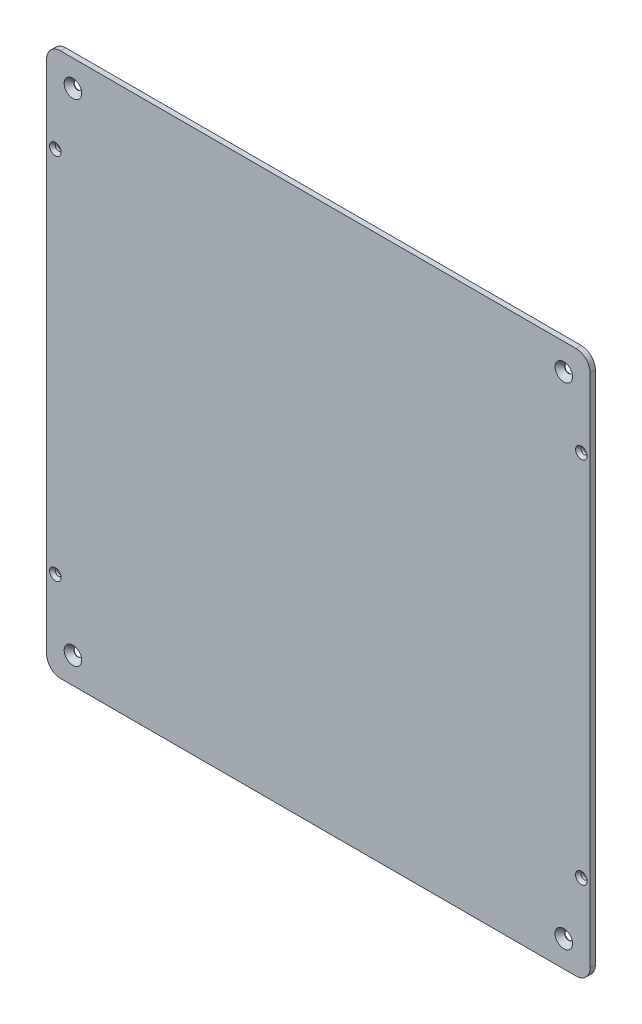
ISO-10303-21;
HEADER;
FILE_DESCRIPTION(('STEP AP214'),'2;1');
FILE_NAME('part.step','',(''),(''),'','','');
FILE_SCHEMA(('AUTOMOTIVE_DESIGN { 1 0 10303 214 1 1 1 1 }'));
ENDSEC;
DATA;
#1=APPLICATION_CONTEXT('core data for automotive mechanical design processes');
#2=APPLICATION_PROTOCOL_DEFINITION('international standard','automotive_design',2000,#1);
#3=PRODUCT_CONTEXT('',#1,'mechanical');
#4=PRODUCT('Part','Part','',(#3));
#5=PRODUCT_RELATED_PRODUCT_CATEGORY('part','',(#4));
#6=PRODUCT_DEFINITION_FORMATION('','',#4);
#7=PRODUCT_DEFINITION_CONTEXT('part definition',#1,'design');
#8=PRODUCT_DEFINITION('design','',#6,#7);
#9=PRODUCT_DEFINITION_SHAPE('','',#8);
#10=(LENGTH_UNIT() NAMED_UNIT(*) SI_UNIT(.MILLI.,.METRE.));
#11=(NAMED_UNIT(*) PLANE_ANGLE_UNIT() SI_UNIT($,.RADIAN.));
#12=(NAMED_UNIT(*) SI_UNIT($,.STERADIAN.) SOLID_ANGLE_UNIT());
#13=UNCERTAINTY_MEASURE_WITH_UNIT(LENGTH_MEASURE(1.E-05),#10,'distance_accuracy_value','');
#14=(GEOMETRIC_REPRESENTATION_CONTEXT(3) GLOBAL_UNCERTAINTY_ASSIGNED_CONTEXT((#13)) GLOBAL_UNIT_ASSIGNED_CONTEXT((#10,
#11,#12)) REPRESENTATION_CONTEXT('',''));
#15=CARTESIAN_POINT('',(0.,0.,0.));
#16=DIRECTION('',(0.,0.,1.));
#17=DIRECTION('',(1.,0.,0.));
#18=AXIS2_PLACEMENT_3D('',#15,#16,#17);
#19=CARTESIAN_POINT('',(147.,-147.,0.));
#20=DIRECTION('',(0.,0.,1.));
#21=DIRECTION('',(1.,0.,0.));
#22=AXIS2_PLACEMENT_3D('',#19,#20,#21);
#23=PLANE('',#22);
#24=CARTESIAN_POINT('',(150.,-105.,0.));
#25=DIRECTION('',(0.,0.,1.));
#26=DIRECTION('',(1.,0.,0.));
#27=AXIS2_PLACEMENT_3D('',#24,#25,#26);
#28=CIRCLE('',#27,1.70000000000001);
#29=CARTESIAN_POINT('',(151.7,-105.,0.));
#30=VERTEX_POINT('',#29);
#31=EDGE_CURVE('E38',#30,#30,#28,.T.);
#32=ORIENTED_EDGE('',*,*,#31,.T.);
#33=EDGE_LOOP('',(#32));
#34=FACE_BOUND('',#33,.T.);
#35=CARTESIAN_POINT('',(150.,105.,0.));
#36=DIRECTION('',(0.,0.,1.));
#37=DIRECTION('',(1.,0.,0.));
#38=AXIS2_PLACEMENT_3D('',#35,#36,#37);
#39=CIRCLE('',#38,1.70000000000001);
#40=CARTESIAN_POINT('',(151.7,105.,0.));
#41=VERTEX_POINT('',#40);
#42=EDGE_CURVE('E306',#41,#41,#39,.T.);
#43=ORIENTED_EDGE('',*,*,#42,.T.);
#44=EDGE_LOOP('',(#43));
#45=FACE_BOUND('',#44,.T.);
#46=CARTESIAN_POINT('',(-150.,105.,0.));
#47=DIRECTION('',(0.,0.,1.));
#48=DIRECTION('',(1.,0.,0.));
#49=AXIS2_PLACEMENT_3D('',#46,#47,#48);
#50=CIRCLE('',#49,1.70000000000001);
#51=CARTESIAN_POINT('',(-148.3,105.,0.));
#52=VERTEX_POINT('',#51);
#53=EDGE_CURVE('E302',#52,#52,#50,.T.);
#54=ORIENTED_EDGE('',*,*,#53,.T.);
#55=EDGE_LOOP('',(#54));
#56=FACE_BOUND('',#55,.T.);
#57=CARTESIAN_POINT('',(-150.,-105.,0.));
#58=DIRECTION('',(0.,0.,1.));
#59=DIRECTION('',(1.,0.,0.));
#60=AXIS2_PLACEMENT_3D('',#57,#58,#59);
#61=CIRCLE('',#60,1.70000000000001);
#62=CARTESIAN_POINT('',(-148.3,-105.,0.));
#63=VERTEX_POINT('',#62);
#64=EDGE_CURVE('E298',#63,#63,#61,.T.);
#65=ORIENTED_EDGE('',*,*,#64,.T.);
#66=EDGE_LOOP('',(#65));
#67=FACE_BOUND('',#66,.T.);
#68=DIRECTION('',(1.,0.,0.));
#69=VECTOR('',#68,1.);
#70=CARTESIAN_POINT('',(23.,119.,0.));
#71=LINE('',#70,#69);
#72=CARTESIAN_POINT('',(15.,119.,0.));
#73=VERTEX_POINT('',#72);
#74=CARTESIAN_POINT('',(23.,119.,0.));
#75=VERTEX_POINT('',#74);
#76=EDGE_CURVE('E170',#73,#75,#71,.T.);
#77=ORIENTED_EDGE('',*,*,#76,.F.);
#78=DIRECTION('',(0.,1.,0.));
#79=VECTOR('',#78,1.);
#80=CARTESIAN_POINT('',(15.,119.,0.));
#81=LINE('',#80,#79);
#82=CARTESIAN_POINT('',(15.,104.,0.));
#83=VERTEX_POINT('',#82);
#84=EDGE_CURVE('E183',#83,#73,#81,.T.);
#85=ORIENTED_EDGE('',*,*,#84,.F.);
#86=DIRECTION('',(-1.,0.,0.));
#87=VECTOR('',#86,1.);
#88=CARTESIAN_POINT('',(15.,104.,0.));
#89=LINE('',#88,#87);
#90=CARTESIAN_POINT('',(23.,104.,0.));
#91=VERTEX_POINT('',#90);
#92=EDGE_CURVE('E192',#91,#83,#89,.T.);
#93=ORIENTED_EDGE('',*,*,#92,.F.);
#94=DIRECTION('',(0.,-1.,0.));
#95=VECTOR('',#94,1.);
#96=CARTESIAN_POINT('',(23.,104.,0.));
#97=LINE('',#96,#95);
#98=EDGE_CURVE('E173',#75,#91,#97,.T.);
#99=ORIENTED_EDGE('',*,*,#98,.F.);
#100=EDGE_LOOP('',(#77,#85,#93,#99));
#101=FACE_BOUND('',#100,.T.);
#102=CARTESIAN_POINT('',(-140.,140.,0.));
#103=DIRECTION('',(0.,0.,1.));
#104=DIRECTION('',(1.,0.,0.));
#105=AXIS2_PLACEMENT_3D('',#102,#103,#104);
#106=CIRCLE('',#105,2.25);
#107=CARTESIAN_POINT('',(-137.75,140.,0.));
#108=VERTEX_POINT('',#107);
#109=EDGE_CURVE('E214',#108,#108,#106,.T.);
#110=ORIENTED_EDGE('',*,*,#109,.T.);
#111=EDGE_LOOP('',(#110));
#112=FACE_BOUND('',#111,.T.);
#113=CARTESIAN_POINT('',(140.,140.,0.));
#114=DIRECTION('',(0.,0.,1.));
#115=DIRECTION('',(1.,0.,0.));
#116=AXIS2_PLACEMENT_3D('',#113,#114,#115);
#117=CIRCLE('',#116,2.25);
#118=CARTESIAN_POINT('',(142.25,140.,0.));
#119=VERTEX_POINT('',#118);
#120=EDGE_CURVE('E223',#119,#119,#117,.T.);
#121=ORIENTED_EDGE('',*,*,#120,.T.);
#122=EDGE_LOOP('',(#121));
#123=FACE_BOUND('',#122,.T.);
#124=CARTESIAN_POINT('',(140.,-140.,0.));
#125=DIRECTION('',(0.,0.,1.));
#126=DIRECTION('',(1.,0.,0.));
#127=AXIS2_PLACEMENT_3D('',#124,#125,#126);
#128=CIRCLE('',#127,2.25);
#129=CARTESIAN_POINT('',(142.25,-140.,0.));
#130=VERTEX_POINT('',#129);
#131=EDGE_CURVE('E232',#130,#130,#128,.T.);
#132=ORIENTED_EDGE('',*,*,#131,.T.);
#133=EDGE_LOOP('',(#132));
#134=FACE_BOUND('',#133,.T.);
#135=CARTESIAN_POINT('',(-140.,-140.,0.));
#136=DIRECTION('',(0.,0.,1.));
#137=DIRECTION('',(1.,0.,0.));
#138=AXIS2_PLACEMENT_3D('',#135,#136,#137);
#139=CIRCLE('',#138,2.25);
#140=CARTESIAN_POINT('',(-137.75,-140.,0.));
#141=VERTEX_POINT('',#140);
#142=EDGE_CURVE('E241',#141,#141,#139,.T.);
#143=ORIENTED_EDGE('',*,*,#142,.T.);
#144=EDGE_LOOP('',(#143));
#145=FACE_BOUND('',#144,.T.);
#146=CARTESIAN_POINT('',(147.,-147.,0.));
#147=DIRECTION('',(0.,0.,1.));
#148=DIRECTION('',(1.,0.,0.));
#149=AXIS2_PLACEMENT_3D('',#146,#147,#148);
#150=CIRCLE('',#149,8.00000000000001);
#151=CARTESIAN_POINT('',(147.,-155.,0.));
#152=VERTEX_POINT('',#151);
#153=CARTESIAN_POINT('',(155.,-147.,0.));
#154=VERTEX_POINT('',#153);
#155=EDGE_CURVE('E244',#152,#154,#150,.T.);
#156=ORIENTED_EDGE('',*,*,#155,.F.);
#157=DIRECTION('',(1.,0.,0.));
#158=VECTOR('',#157,1.);
#159=CARTESIAN_POINT('',(-147.,-155.,0.));
#160=LINE('',#159,#158);
#161=CARTESIAN_POINT('',(-147.,-155.,0.));
#162=VERTEX_POINT('',#161);
#163=EDGE_CURVE('E249',#162,#152,#160,.T.);
#164=ORIENTED_EDGE('',*,*,#163,.F.);
#165=CARTESIAN_POINT('',(-147.,-147.,0.));
#166=DIRECTION('',(0.,0.,1.));
#167=DIRECTION('',(1.,0.,0.));
#168=AXIS2_PLACEMENT_3D('',#165,#166,#167);
#169=CIRCLE('',#168,8.00000000000001);
#170=CARTESIAN_POINT('',(-155.,-147.,0.));
#171=VERTEX_POINT('',#170);
#172=EDGE_CURVE('E276',#171,#162,#169,.T.);
#173=ORIENTED_EDGE('',*,*,#172,.F.);
#174=DIRECTION('',(0.,-1.,0.));
#175=VECTOR('',#174,1.);
#176=CARTESIAN_POINT('',(-155.,147.,0.));
#177=LINE('',#176,#175);
#178=CARTESIAN_POINT('',(-155.,147.,0.));
#179=VERTEX_POINT('',#178);
#180=EDGE_CURVE('E274',#179,#171,#177,.T.);
#181=ORIENTED_EDGE('',*,*,#180,.F.);
#182=CARTESIAN_POINT('',(-147.,147.,0.));
#183=DIRECTION('',(0.,0.,1.));
#184=DIRECTION('',(1.,0.,0.));
#185=AXIS2_PLACEMENT_3D('',#182,#183,#184);
#186=CIRCLE('',#185,8.00000000000001);
#187=CARTESIAN_POINT('',(-147.,155.,0.));
#188=VERTEX_POINT('',#187);
#189=EDGE_CURVE('E272',#188,#179,#186,.T.);
#190=ORIENTED_EDGE('',*,*,#189,.F.);
#191=DIRECTION('',(-1.,0.,0.));
#192=VECTOR('',#191,1.);
#193=CARTESIAN_POINT('',(-147.,155.,0.));
#194=LINE('',#193,#192);
#195=CARTESIAN_POINT('',(147.,155.,0.));
#196=VERTEX_POINT('',#195);
#197=EDGE_CURVE('E270',#196,#188,#194,.T.);
#198=ORIENTED_EDGE('',*,*,#197,.F.);
#199=CARTESIAN_POINT('',(147.,147.,0.));
#200=DIRECTION('',(0.,0.,1.));
#201=DIRECTION('',(-1.,0.,0.));
#202=AXIS2_PLACEMENT_3D('',#199,#200,#201);
#203=CIRCLE('',#202,8.00000000000001);
#204=CARTESIAN_POINT('',(155.,147.,0.));
#205=VERTEX_POINT('',#204);
#206=EDGE_CURVE('E268',#205,#196,#203,.T.);
#207=ORIENTED_EDGE('',*,*,#206,.F.);
#208=DIRECTION('',(0.,1.,0.));
#209=VECTOR('',#208,1.);
#210=CARTESIAN_POINT('',(155.,147.,0.));
#211=LINE('',#210,#209);
#212=EDGE_CURVE('E266',#154,#205,#211,.T.);
#213=ORIENTED_EDGE('',*,*,#212,.F.);
#214=EDGE_LOOP('',(#156,#164,#173,#181,#190,#198,#207,#213));
#215=FACE_BOUND('',#214,.T.);
#216=DIRECTION('',(1.,0.,0.));
#217=VECTOR('',#216,1.);
#218=CARTESIAN_POINT('',(37.,119.,0.));
#219=LINE('',#218,#217);
#220=CARTESIAN_POINT('',(29.,119.,0.));
#221=VERTEX_POINT('',#220);
#222=CARTESIAN_POINT('',(37.,119.,0.));
#223=VERTEX_POINT('',#222);
#224=EDGE_CURVE('E169',#221,#223,#219,.T.);
#225=ORIENTED_EDGE('',*,*,#224,.F.);
#226=DIRECTION('',(0.,1.,0.));
#227=VECTOR('',#226,1.);
#228=CARTESIAN_POINT('',(29.,119.,0.));
#229=LINE('',#228,#227);
#230=CARTESIAN_POINT('',(29.,104.,0.));
#231=VERTEX_POINT('',#230);
#232=EDGE_CURVE('E166',#231,#221,#229,.T.);
#233=ORIENTED_EDGE('',*,*,#232,.F.);
#234=DIRECTION('',(-1.,0.,0.));
#235=VECTOR('',#234,1.);
#236=CARTESIAN_POINT('',(29.,104.,0.));
#237=LINE('',#236,#235);
#238=CARTESIAN_POINT('',(37.,104.,0.));
#239=VERTEX_POINT('',#238);
#240=EDGE_CURVE('E56',#239,#231,#237,.T.);
#241=ORIENTED_EDGE('',*,*,#240,.F.);
#242=DIRECTION('',(0.,-1.,0.));
#243=VECTOR('',#242,1.);
#244=CARTESIAN_POINT('',(37.,104.,0.));
#245=LINE('',#244,#243);
#246=EDGE_CURVE('E51',#223,#239,#245,.T.);
#247=ORIENTED_EDGE('',*,*,#246,.F.);
#248=EDGE_LOOP('',(#225,#233,#241,#247));
#249=FACE_BOUND('',#248,.T.);
#250=ADVANCED_FACE('F34',(#34,#45,#56,#67,#101,#112,#123,#134,#145,#215,#249),#23,.F.);
#251=CARTESIAN_POINT('',(147.,-147.,3.));
#252=DIRECTION('',(0.,0.,-1.));
#253=DIRECTION('',(-1.,0.,0.));
#254=AXIS2_PLACEMENT_3D('',#251,#252,#253);
#255=CYLINDRICAL_SURFACE('',#254,8.00000000000001);
#256=ORIENTED_EDGE('',*,*,#155,.T.);
#257=DIRECTION('',(0.,0.,-1.));
#258=VECTOR('',#257,1.);
#259=CARTESIAN_POINT('',(155.,-147.,3.));
#260=LINE('',#259,#258);
#261=CARTESIAN_POINT('',(155.,-147.,3.));
#262=VERTEX_POINT('',#261);
#263=EDGE_CURVE('E11',#262,#154,#260,.T.);
#264=ORIENTED_EDGE('',*,*,#263,.F.);
#265=CARTESIAN_POINT('',(147.,-147.,3.));
#266=DIRECTION('',(0.,0.,1.));
#267=DIRECTION('',(1.,0.,0.));
#268=AXIS2_PLACEMENT_3D('',#265,#266,#267);
#269=CIRCLE('',#268,8.00000000000001);
#270=CARTESIAN_POINT('',(147.,-155.,3.));
#271=VERTEX_POINT('',#270);
#272=EDGE_CURVE('E245',#271,#262,#269,.T.);
#273=ORIENTED_EDGE('',*,*,#272,.F.);
#274=DIRECTION('',(0.,0.,-1.));
#275=VECTOR('',#274,1.);
#276=CARTESIAN_POINT('',(147.,-155.,3.));
#277=LINE('',#276,#275);
#278=EDGE_CURVE('E263',#271,#152,#277,.T.);
#279=ORIENTED_EDGE('',*,*,#278,.T.);
#280=EDGE_LOOP('',(#256,#264,#273,#279));
#281=FACE_BOUND('',#280,.T.);
#282=ADVANCED_FACE('F36',(#281),#255,.T.);
#283=CARTESIAN_POINT('',(155.,147.,3.));
#284=DIRECTION('',(-1.,0.,0.));
#285=DIRECTION('',(0.,-1.,0.));
#286=AXIS2_PLACEMENT_3D('',#283,#284,#285);
#287=PLANE('',#286);
#288=ORIENTED_EDGE('',*,*,#212,.T.);
#289=DIRECTION('',(0.,0.,-1.));
#290=VECTOR('',#289,1.);
#291=CARTESIAN_POINT('',(155.,147.,3.));
#292=LINE('',#291,#290);
#293=CARTESIAN_POINT('',(155.,147.,3.));
#294=VERTEX_POINT('',#293);
#295=EDGE_CURVE('E43',#294,#205,#292,.T.);
#296=ORIENTED_EDGE('',*,*,#295,.F.);
#297=DIRECTION('',(0.,1.,0.));
#298=VECTOR('',#297,1.);
#299=CARTESIAN_POINT('',(155.,147.,3.));
#300=LINE('',#299,#298);
#301=EDGE_CURVE('E248',#262,#294,#300,.T.);
#302=ORIENTED_EDGE('',*,*,#301,.F.);
#303=ORIENTED_EDGE('',*,*,#263,.T.);
#304=EDGE_LOOP('',(#288,#296,#302,#303));
#305=FACE_BOUND('',#304,.T.);
#306=ADVANCED_FACE('F357',(#305),#287,.F.);
#307=CARTESIAN_POINT('',(147.,147.,3.));
#308=DIRECTION('',(0.,0.,-1.));
#309=DIRECTION('',(-1.,0.,0.));
#310=AXIS2_PLACEMENT_3D('',#307,#308,#309);
#311=CYLINDRICAL_SURFACE('',#310,8.00000000000001);
#312=ORIENTED_EDGE('',*,*,#206,.T.);
#313=DIRECTION('',(0.,0.,-1.));
#314=VECTOR('',#313,1.);
#315=CARTESIAN_POINT('',(147.,155.,3.));
#316=LINE('',#315,#314);
#317=CARTESIAN_POINT('',(147.,155.,3.));
#318=VERTEX_POINT('',#317);
#319=EDGE_CURVE('E293',#318,#196,#316,.T.);
#320=ORIENTED_EDGE('',*,*,#319,.F.);
#321=CARTESIAN_POINT('',(147.,147.,3.));
#322=DIRECTION('',(0.,0.,1.));
#323=DIRECTION('',(-1.,0.,0.));
#324=AXIS2_PLACEMENT_3D('',#321,#322,#323);
#325=CIRCLE('',#324,8.00000000000001);
#326=EDGE_CURVE('E251',#294,#318,#325,.T.);
#327=ORIENTED_EDGE('',*,*,#326,.F.);
#328=ORIENTED_EDGE('',*,*,#295,.T.);
#329=EDGE_LOOP('',(#312,#320,#327,#328));
#330=FACE_BOUND('',#329,.T.);
#331=ADVANCED_FACE('F383',(#330),#311,.T.);
#332=CARTESIAN_POINT('',(-147.,155.,3.));
#333=DIRECTION('',(0.,-1.,0.));
#334=DIRECTION('',(1.,0.,0.));
#335=AXIS2_PLACEMENT_3D('',#332,#333,#334);
#336=PLANE('',#335);
#337=ORIENTED_EDGE('',*,*,#197,.T.);
#338=DIRECTION('',(0.,0.,-1.));
#339=VECTOR('',#338,1.);
#340=CARTESIAN_POINT('',(-147.,155.,3.));
#341=LINE('',#340,#339);
#342=CARTESIAN_POINT('',(-147.,155.,3.));
#343=VERTEX_POINT('',#342);
#344=EDGE_CURVE('E290',#343,#188,#341,.T.);
#345=ORIENTED_EDGE('',*,*,#344,.F.);
#346=DIRECTION('',(-1.,0.,0.));
#347=VECTOR('',#346,1.);
#348=CARTESIAN_POINT('',(-147.,155.,3.));
#349=LINE('',#348,#347);
#350=EDGE_CURVE('E253',#318,#343,#349,.T.);
#351=ORIENTED_EDGE('',*,*,#350,.F.);
#352=ORIENTED_EDGE('',*,*,#319,.T.);
#353=EDGE_LOOP('',(#337,#345,#351,#352));
#354=FACE_BOUND('',#353,.T.);
#355=ADVANCED_FACE('F379',(#354),#336,.F.);
#356=CARTESIAN_POINT('',(-147.,147.,3.));
#357=DIRECTION('',(0.,0.,-1.));
#358=DIRECTION('',(-1.,0.,0.));
#359=AXIS2_PLACEMENT_3D('',#356,#357,#358);
#360=CYLINDRICAL_SURFACE('',#359,8.00000000000001);
#361=ORIENTED_EDGE('',*,*,#189,.T.);
#362=DIRECTION('',(0.,0.,-1.));
#363=VECTOR('',#362,1.);
#364=CARTESIAN_POINT('',(-155.,147.,3.));
#365=LINE('',#364,#363);
#366=CARTESIAN_POINT('',(-155.,147.,3.));
#367=VERTEX_POINT('',#366);
#368=EDGE_CURVE('E287',#367,#179,#365,.T.);
#369=ORIENTED_EDGE('',*,*,#368,.F.);
#370=CARTESIAN_POINT('',(-147.,147.,3.));
#371=DIRECTION('',(0.,0.,1.));
#372=DIRECTION('',(1.,0.,0.));
#373=AXIS2_PLACEMENT_3D('',#370,#371,#372);
#374=CIRCLE('',#373,8.00000000000001);
#375=EDGE_CURVE('E255',#343,#367,#374,.T.);
#376=ORIENTED_EDGE('',*,*,#375,.F.);
#377=ORIENTED_EDGE('',*,*,#344,.T.);
#378=EDGE_LOOP('',(#361,#369,#376,#377));
#379=FACE_BOUND('',#378,.T.);
#380=ADVANCED_FACE('F375',(#379),#360,.T.);
#381=CARTESIAN_POINT('',(-155.,147.,3.));
#382=DIRECTION('',(1.,0.,0.));
#383=DIRECTION('',(0.,1.,0.));
#384=AXIS2_PLACEMENT_3D('',#381,#382,#383);
#385=PLANE('',#384);
#386=ORIENTED_EDGE('',*,*,#180,.T.);
#387=DIRECTION('',(0.,0.,-1.));
#388=VECTOR('',#387,1.);
#389=CARTESIAN_POINT('',(-155.,-147.,3.));
#390=LINE('',#389,#388);
#391=CARTESIAN_POINT('',(-155.,-147.,3.));
#392=VERTEX_POINT('',#391);
#393=EDGE_CURVE('E284',#392,#171,#390,.T.);
#394=ORIENTED_EDGE('',*,*,#393,.F.);
#395=DIRECTION('',(0.,-1.,0.));
#396=VECTOR('',#395,1.);
#397=CARTESIAN_POINT('',(-155.,147.,3.));
#398=LINE('',#397,#396);
#399=EDGE_CURVE('E257',#367,#392,#398,.T.);
#400=ORIENTED_EDGE('',*,*,#399,.F.);
#401=ORIENTED_EDGE('',*,*,#368,.T.);
#402=EDGE_LOOP('',(#386,#394,#400,#401));
#403=FACE_BOUND('',#402,.T.);
#404=ADVANCED_FACE('F371',(#403),#385,.F.);
#405=CARTESIAN_POINT('',(-147.,-147.,3.));
#406=DIRECTION('',(0.,0.,-1.));
#407=DIRECTION('',(-1.,0.,0.));
#408=AXIS2_PLACEMENT_3D('',#405,#406,#407);
#409=CYLINDRICAL_SURFACE('',#408,8.00000000000001);
#410=ORIENTED_EDGE('',*,*,#172,.T.);
#411=DIRECTION('',(0.,0.,-1.));
#412=VECTOR('',#411,1.);
#413=CARTESIAN_POINT('',(-147.,-155.,3.));
#414=LINE('',#413,#412);
#415=CARTESIAN_POINT('',(-147.,-155.,3.));
#416=VERTEX_POINT('',#415);
#417=EDGE_CURVE('E281',#416,#162,#414,.T.);
#418=ORIENTED_EDGE('',*,*,#417,.F.);
#419=CARTESIAN_POINT('',(-147.,-147.,3.));
#420=DIRECTION('',(0.,0.,1.));
#421=DIRECTION('',(1.,0.,0.));
#422=AXIS2_PLACEMENT_3D('',#419,#420,#421);
#423=CIRCLE('',#422,8.00000000000001);
#424=EDGE_CURVE('E259',#392,#416,#423,.T.);
#425=ORIENTED_EDGE('',*,*,#424,.F.);
#426=ORIENTED_EDGE('',*,*,#393,.T.);
#427=EDGE_LOOP('',(#410,#418,#425,#426));
#428=FACE_BOUND('',#427,.T.);
#429=ADVANCED_FACE('F367',(#428),#409,.T.);
#430=CARTESIAN_POINT('',(-147.,-155.,3.));
#431=DIRECTION('',(0.,1.,0.));
#432=DIRECTION('',(0.,0.,1.));
#433=AXIS2_PLACEMENT_3D('',#430,#431,#432);
#434=PLANE('',#433);
#435=ORIENTED_EDGE('',*,*,#163,.T.);
#436=ORIENTED_EDGE('',*,*,#278,.F.);
#437=DIRECTION('',(1.,0.,0.));
#438=VECTOR('',#437,1.);
#439=CARTESIAN_POINT('',(-147.,-155.,3.));
#440=LINE('',#439,#438);
#441=EDGE_CURVE('E261',#416,#271,#440,.T.);
#442=ORIENTED_EDGE('',*,*,#441,.F.);
#443=ORIENTED_EDGE('',*,*,#417,.T.);
#444=EDGE_LOOP('',(#435,#436,#442,#443));
#445=FACE_BOUND('',#444,.T.);
#446=ADVANCED_FACE('F364',(#445),#434,.F.);
#447=CARTESIAN_POINT('',(147.,-147.,3.));
#448=DIRECTION('',(0.,0.,1.));
#449=DIRECTION('',(1.,0.,0.));
#450=AXIS2_PLACEMENT_3D('',#447,#448,#449);
#451=PLANE('',#450);
#452=CARTESIAN_POINT('',(150.,-105.,3.));
#453=DIRECTION('',(0.,0.,1.));
#454=DIRECTION('',(1.,0.,0.));
#455=AXIS2_PLACEMENT_3D('',#452,#453,#454);
#456=CIRCLE('',#455,3.3);
#457=CARTESIAN_POINT('',(153.3,-105.,3.));
#458=VERTEX_POINT('',#457);
#459=EDGE_CURVE('E426',#458,#458,#456,.T.);
#460=ORIENTED_EDGE('',*,*,#459,.F.);
#461=EDGE_LOOP('',(#460));
#462=FACE_BOUND('',#461,.T.);
#463=CARTESIAN_POINT('',(150.,105.,3.));
#464=DIRECTION('',(0.,0.,1.));
#465=DIRECTION('',(1.,0.,0.));
#466=AXIS2_PLACEMENT_3D('',#463,#464,#465);
#467=CIRCLE('',#466,3.3);
#468=CARTESIAN_POINT('',(153.3,105.,3.));
#469=VERTEX_POINT('',#468);
#470=EDGE_CURVE('E315',#469,#469,#467,.T.);
#471=ORIENTED_EDGE('',*,*,#470,.F.);
#472=EDGE_LOOP('',(#471));
#473=FACE_BOUND('',#472,.T.);
#474=CARTESIAN_POINT('',(-150.,105.,3.));
#475=DIRECTION('',(0.,0.,1.));
#476=DIRECTION('',(1.,0.,0.));
#477=AXIS2_PLACEMENT_3D('',#474,#475,#476);
#478=CIRCLE('',#477,3.3);
#479=CARTESIAN_POINT('',(-146.7,105.,3.));
#480=VERTEX_POINT('',#479);
#481=EDGE_CURVE('E308',#480,#480,#478,.T.);
#482=ORIENTED_EDGE('',*,*,#481,.F.);
#483=EDGE_LOOP('',(#482));
#484=FACE_BOUND('',#483,.T.);
#485=CARTESIAN_POINT('',(-150.,-105.,3.));
#486=DIRECTION('',(0.,0.,1.));
#487=DIRECTION('',(1.,0.,0.));
#488=AXIS2_PLACEMENT_3D('',#485,#486,#487);
#489=CIRCLE('',#488,3.3);
#490=CARTESIAN_POINT('',(-146.7,-105.,3.));
#491=VERTEX_POINT('',#490);
#492=EDGE_CURVE('E304',#491,#491,#489,.T.);
#493=ORIENTED_EDGE('',*,*,#492,.F.);
#494=EDGE_LOOP('',(#493));
#495=FACE_BOUND('',#494,.T.);
#496=CARTESIAN_POINT('',(-140.,140.,3.));
#497=DIRECTION('',(0.,0.,1.));
#498=DIRECTION('',(1.,0.,0.));
#499=AXIS2_PLACEMENT_3D('',#496,#497,#498);
#500=CIRCLE('',#499,5.);
#501=CARTESIAN_POINT('',(-135.,140.,3.));
#502=VERTEX_POINT('',#501);
#503=EDGE_CURVE('E208',#502,#502,#500,.T.);
#504=ORIENTED_EDGE('',*,*,#503,.F.);
#505=EDGE_LOOP('',(#504));
#506=FACE_BOUND('',#505,.T.);
#507=CARTESIAN_POINT('',(140.,140.,3.));
#508=DIRECTION('',(0.,0.,1.));
#509=DIRECTION('',(1.,0.,0.));
#510=AXIS2_PLACEMENT_3D('',#507,#508,#509);
#511=CIRCLE('',#510,5.);
#512=CARTESIAN_POINT('',(145.,140.,3.));
#513=VERTEX_POINT('',#512);
#514=EDGE_CURVE('E217',#513,#513,#511,.T.);
#515=ORIENTED_EDGE('',*,*,#514,.F.);
#516=EDGE_LOOP('',(#515));
#517=FACE_BOUND('',#516,.T.);
#518=CARTESIAN_POINT('',(140.,-140.,3.));
#519=DIRECTION('',(0.,0.,1.));
#520=DIRECTION('',(1.,0.,0.));
#521=AXIS2_PLACEMENT_3D('',#518,#519,#520);
#522=CIRCLE('',#521,5.);
#523=CARTESIAN_POINT('',(145.,-140.,3.));
#524=VERTEX_POINT('',#523);
#525=EDGE_CURVE('E226',#524,#524,#522,.T.);
#526=ORIENTED_EDGE('',*,*,#525,.F.);
#527=EDGE_LOOP('',(#526));
#528=FACE_BOUND('',#527,.T.);
#529=CARTESIAN_POINT('',(-140.,-140.,3.));
#530=DIRECTION('',(0.,0.,1.));
#531=DIRECTION('',(1.,0.,0.));
#532=AXIS2_PLACEMENT_3D('',#529,#530,#531);
#533=CIRCLE('',#532,5.);
#534=CARTESIAN_POINT('',(-135.,-140.,3.));
#535=VERTEX_POINT('',#534);
#536=EDGE_CURVE('E235',#535,#535,#533,.T.);
#537=ORIENTED_EDGE('',*,*,#536,.F.);
#538=EDGE_LOOP('',(#537));
#539=FACE_BOUND('',#538,.T.);
#540=ORIENTED_EDGE('',*,*,#272,.T.);
#541=ORIENTED_EDGE('',*,*,#301,.T.);
#542=ORIENTED_EDGE('',*,*,#326,.T.);
#543=ORIENTED_EDGE('',*,*,#350,.T.);
#544=ORIENTED_EDGE('',*,*,#375,.T.);
#545=ORIENTED_EDGE('',*,*,#399,.T.);
#546=ORIENTED_EDGE('',*,*,#424,.T.);
#547=ORIENTED_EDGE('',*,*,#441,.T.);
#548=EDGE_LOOP('',(#540,#541,#542,#543,#544,#545,#546,#547));
#549=FACE_BOUND('',#548,.T.);
#550=ADVANCED_FACE('F362',(#462,#473,#484,#495,#506,#517,#528,#539,#549),#451,.T.);
#551=CARTESIAN_POINT('',(-140.,-140.,3.));
#552=DIRECTION('',(0.,0.,1.));
#553=DIRECTION('',(1.,0.,0.));
#554=AXIS2_PLACEMENT_3D('',#551,#552,#553);
#555=CYLINDRICAL_SURFACE('',#554,2.25);
#556=ORIENTED_EDGE('',*,*,#142,.F.);
#557=EDGE_LOOP('',(#556));
#558=FACE_BOUND('',#557,.T.);
#559=CARTESIAN_POINT('',(-140.,-140.,0.25));
#560=DIRECTION('',(0.,0.,1.));
#561=DIRECTION('',(1.,0.,0.));
#562=AXIS2_PLACEMENT_3D('',#559,#560,#561);
#563=CIRCLE('',#562,2.25);
#564=CARTESIAN_POINT('',(-137.75,-140.,0.25));
#565=VERTEX_POINT('',#564);
#566=EDGE_CURVE('E238',#565,#565,#563,.T.);
#567=ORIENTED_EDGE('',*,*,#566,.T.);
#568=EDGE_LOOP('',(#567));
#569=FACE_BOUND('',#568,.T.);
#570=ADVANCED_FACE('F416',(#558,#569),#555,.F.);
#571=CARTESIAN_POINT('',(-140.,-140.,3.));
#572=DIRECTION('',(0.,0.,1.));
#573=DIRECTION('',(1.,0.,0.));
#574=AXIS2_PLACEMENT_3D('',#571,#572,#573);
#575=CONICAL_SURFACE('',#574,5.,0.785398163397449);
#576=ORIENTED_EDGE('',*,*,#566,.F.);
#577=EDGE_LOOP('',(#576));
#578=FACE_BOUND('',#577,.T.);
#579=ORIENTED_EDGE('',*,*,#536,.T.);
#580=EDGE_LOOP('',(#579));
#581=FACE_BOUND('',#580,.T.);
#582=ADVANCED_FACE('F421',(#578,#581),#575,.F.);
#583=CARTESIAN_POINT('',(140.,-140.,3.));
#584=DIRECTION('',(0.,0.,1.));
#585=DIRECTION('',(1.,0.,0.));
#586=AXIS2_PLACEMENT_3D('',#583,#584,#585);
#587=CYLINDRICAL_SURFACE('',#586,2.25);
#588=ORIENTED_EDGE('',*,*,#131,.F.);
#589=EDGE_LOOP('',(#588));
#590=FACE_BOUND('',#589,.T.);
#591=CARTESIAN_POINT('',(140.,-140.,0.25));
#592=DIRECTION('',(0.,0.,1.));
#593=DIRECTION('',(1.,0.,0.));
#594=AXIS2_PLACEMENT_3D('',#591,#592,#593);
#595=CIRCLE('',#594,2.25);
#596=CARTESIAN_POINT('',(142.25,-140.,0.25));
#597=VERTEX_POINT('',#596);
#598=EDGE_CURVE('E229',#597,#597,#595,.T.);
#599=ORIENTED_EDGE('',*,*,#598,.T.);
#600=EDGE_LOOP('',(#599));
#601=FACE_BOUND('',#600,.T.);
#602=ADVANCED_FACE('F442',(#590,#601),#587,.F.);
#603=CARTESIAN_POINT('',(140.,-140.,3.));
#604=DIRECTION('',(0.,0.,1.));
#605=DIRECTION('',(1.,0.,0.));
#606=AXIS2_PLACEMENT_3D('',#603,#604,#605);
#607=CONICAL_SURFACE('',#606,5.,0.785398163397449);
#608=ORIENTED_EDGE('',*,*,#598,.F.);
#609=EDGE_LOOP('',(#608));
#610=FACE_BOUND('',#609,.T.);
#611=ORIENTED_EDGE('',*,*,#525,.T.);
#612=EDGE_LOOP('',(#611));
#613=FACE_BOUND('',#612,.T.);
#614=ADVANCED_FACE('F448',(#610,#613),#607,.F.);
#615=CARTESIAN_POINT('',(140.,140.,3.));
#616=DIRECTION('',(0.,0.,1.));
#617=DIRECTION('',(1.,0.,0.));
#618=AXIS2_PLACEMENT_3D('',#615,#616,#617);
#619=CYLINDRICAL_SURFACE('',#618,2.25);
#620=ORIENTED_EDGE('',*,*,#120,.F.);
#621=EDGE_LOOP('',(#620));
#622=FACE_BOUND('',#621,.T.);
#623=CARTESIAN_POINT('',(140.,140.,0.25));
#624=DIRECTION('',(0.,0.,1.));
#625=DIRECTION('',(1.,0.,0.));
#626=AXIS2_PLACEMENT_3D('',#623,#624,#625);
#627=CIRCLE('',#626,2.25);
#628=CARTESIAN_POINT('',(142.25,140.,0.25));
#629=VERTEX_POINT('',#628);
#630=EDGE_CURVE('E220',#629,#629,#627,.T.);
#631=ORIENTED_EDGE('',*,*,#630,.T.);
#632=EDGE_LOOP('',(#631));
#633=FACE_BOUND('',#632,.T.);
#634=ADVANCED_FACE('F455',(#622,#633),#619,.F.);
#635=CARTESIAN_POINT('',(140.,140.,3.));
#636=DIRECTION('',(0.,0.,1.));
#637=DIRECTION('',(1.,0.,0.));
#638=AXIS2_PLACEMENT_3D('',#635,#636,#637);
#639=CONICAL_SURFACE('',#638,5.,0.785398163397449);
#640=ORIENTED_EDGE('',*,*,#630,.F.);
#641=EDGE_LOOP('',(#640));
#642=FACE_BOUND('',#641,.T.);
#643=ORIENTED_EDGE('',*,*,#514,.T.);
#644=EDGE_LOOP('',(#643));
#645=FACE_BOUND('',#644,.T.);
#646=ADVANCED_FACE('F459',(#642,#645),#639,.F.);
#647=CARTESIAN_POINT('',(-140.,140.,3.));
#648=DIRECTION('',(0.,0.,1.));
#649=DIRECTION('',(1.,0.,0.));
#650=AXIS2_PLACEMENT_3D('',#647,#648,#649);
#651=CYLINDRICAL_SURFACE('',#650,2.25);
#652=ORIENTED_EDGE('',*,*,#109,.F.);
#653=EDGE_LOOP('',(#652));
#654=FACE_BOUND('',#653,.T.);
#655=CARTESIAN_POINT('',(-140.,140.,0.25));
#656=DIRECTION('',(0.,0.,1.));
#657=DIRECTION('',(1.,0.,0.));
#658=AXIS2_PLACEMENT_3D('',#655,#656,#657);
#659=CIRCLE('',#658,2.25);
#660=CARTESIAN_POINT('',(-137.75,140.,0.25));
#661=VERTEX_POINT('',#660);
#662=EDGE_CURVE('E211',#661,#661,#659,.T.);
#663=ORIENTED_EDGE('',*,*,#662,.T.);
#664=EDGE_LOOP('',(#663));
#665=FACE_BOUND('',#664,.T.);
#666=ADVANCED_FACE('F463',(#654,#665),#651,.F.);
#667=CARTESIAN_POINT('',(-140.,140.,3.));
#668=DIRECTION('',(0.,0.,1.));
#669=DIRECTION('',(1.,0.,0.));
#670=AXIS2_PLACEMENT_3D('',#667,#668,#669);
#671=CONICAL_SURFACE('',#670,5.,0.785398163397449);
#672=ORIENTED_EDGE('',*,*,#662,.F.);
#673=EDGE_LOOP('',(#672));
#674=FACE_BOUND('',#673,.T.);
#675=ORIENTED_EDGE('',*,*,#503,.T.);
#676=EDGE_LOOP('',(#675));
#677=FACE_BOUND('',#676,.T.);
#678=ADVANCED_FACE('F467',(#674,#677),#671,.F.);
#679=CARTESIAN_POINT('',(23.,119.,-1.));
#680=DIRECTION('',(0.,-1.,0.));
#681=DIRECTION('',(0.,0.,-1.));
#682=AXIS2_PLACEMENT_3D('',#679,#680,#681);
#683=PLANE('',#682);
#684=ORIENTED_EDGE('',*,*,#76,.T.);
#685=DIRECTION('',(0.,0.,1.));
#686=VECTOR('',#685,1.);
#687=CARTESIAN_POINT('',(23.,119.,-1.));
#688=LINE('',#687,#686);
#689=CARTESIAN_POINT('',(23.,119.,-1.));
#690=VERTEX_POINT('',#689);
#691=EDGE_CURVE('E205',#690,#75,#688,.T.);
#692=ORIENTED_EDGE('',*,*,#691,.F.);
#693=DIRECTION('',(1.,0.,0.));
#694=VECTOR('',#693,1.);
#695=CARTESIAN_POINT('',(23.,119.,-1.));
#696=LINE('',#695,#694);
#697=CARTESIAN_POINT('',(15.,119.,-1.));
#698=VERTEX_POINT('',#697);
#699=EDGE_CURVE('E179',#698,#690,#696,.T.);
#700=ORIENTED_EDGE('',*,*,#699,.F.);
#701=DIRECTION('',(0.,0.,1.));
#702=VECTOR('',#701,1.);
#703=CARTESIAN_POINT('',(15.,119.,-1.));
#704=LINE('',#703,#702);
#705=EDGE_CURVE('E188',#698,#73,#704,.T.);
#706=ORIENTED_EDGE('',*,*,#705,.T.);
#707=EDGE_LOOP('',(#684,#692,#700,#706));
#708=FACE_BOUND('',#707,.T.);
#709=ADVANCED_FACE('F471',(#708),#683,.F.);
#710=CARTESIAN_POINT('',(23.,104.,-1.));
#711=DIRECTION('',(-1.,0.,0.));
#712=DIRECTION('',(0.,0.,1.));
#713=AXIS2_PLACEMENT_3D('',#710,#711,#712);
#714=PLANE('',#713);
#715=ORIENTED_EDGE('',*,*,#98,.T.);
#716=DIRECTION('',(0.,0.,1.));
#717=VECTOR('',#716,1.);
#718=CARTESIAN_POINT('',(23.,104.,-1.));
#719=LINE('',#718,#717);
#720=CARTESIAN_POINT('',(23.,104.,-1.));
#721=VERTEX_POINT('',#720);
#722=EDGE_CURVE('E202',#721,#91,#719,.T.);
#723=ORIENTED_EDGE('',*,*,#722,.F.);
#724=DIRECTION('',(0.,-1.,0.));
#725=VECTOR('',#724,1.);
#726=CARTESIAN_POINT('',(23.,104.,-1.));
#727=LINE('',#726,#725);
#728=EDGE_CURVE('E182',#690,#721,#727,.T.);
#729=ORIENTED_EDGE('',*,*,#728,.F.);
#730=ORIENTED_EDGE('',*,*,#691,.T.);
#731=EDGE_LOOP('',(#715,#723,#729,#730));
#732=FACE_BOUND('',#731,.T.);
#733=ADVANCED_FACE('F475',(#732),#714,.F.);
#734=CARTESIAN_POINT('',(15.,104.,-1.));
#735=DIRECTION('',(0.,1.,0.));
#736=DIRECTION('',(0.,0.,1.));
#737=AXIS2_PLACEMENT_3D('',#734,#735,#736);
#738=PLANE('',#737);
#739=ORIENTED_EDGE('',*,*,#92,.T.);
#740=DIRECTION('',(0.,0.,1.));
#741=VECTOR('',#740,1.);
#742=CARTESIAN_POINT('',(15.,104.,-1.));
#743=LINE('',#742,#741);
#744=CARTESIAN_POINT('',(15.,104.,-1.));
#745=VERTEX_POINT('',#744);
#746=EDGE_CURVE('E199',#745,#83,#743,.T.);
#747=ORIENTED_EDGE('',*,*,#746,.F.);
#748=DIRECTION('',(-1.,0.,0.));
#749=VECTOR('',#748,1.);
#750=CARTESIAN_POINT('',(15.,104.,-1.));
#751=LINE('',#750,#749);
#752=EDGE_CURVE('E185',#721,#745,#751,.T.);
#753=ORIENTED_EDGE('',*,*,#752,.F.);
#754=ORIENTED_EDGE('',*,*,#722,.T.);
#755=EDGE_LOOP('',(#739,#747,#753,#754));
#756=FACE_BOUND('',#755,.T.);
#757=ADVANCED_FACE('F479',(#756),#738,.F.);
#758=CARTESIAN_POINT('',(15.,119.,-1.));
#759=DIRECTION('',(1.,0.,0.));
#760=DIRECTION('',(0.,0.,-1.));
#761=AXIS2_PLACEMENT_3D('',#758,#759,#760);
#762=PLANE('',#761);
#763=ORIENTED_EDGE('',*,*,#84,.T.);
#764=ORIENTED_EDGE('',*,*,#705,.F.);
#765=DIRECTION('',(0.,1.,0.));
#766=VECTOR('',#765,1.);
#767=CARTESIAN_POINT('',(15.,119.,-1.));
#768=LINE('',#767,#766);
#769=EDGE_CURVE('E187',#745,#698,#768,.T.);
#770=ORIENTED_EDGE('',*,*,#769,.F.);
#771=ORIENTED_EDGE('',*,*,#746,.T.);
#772=EDGE_LOOP('',(#763,#764,#770,#771));
#773=FACE_BOUND('',#772,.T.);
#774=ADVANCED_FACE('F483',(#773),#762,.F.);
#775=CARTESIAN_POINT('',(0.,0.,-1.));
#776=DIRECTION('',(0.,0.,1.));
#777=DIRECTION('',(1.,0.,0.));
#778=AXIS2_PLACEMENT_3D('',#775,#776,#777);
#779=PLANE('',#778);
#780=ORIENTED_EDGE('',*,*,#699,.T.);
#781=ORIENTED_EDGE('',*,*,#728,.T.);
#782=ORIENTED_EDGE('',*,*,#752,.T.);
#783=ORIENTED_EDGE('',*,*,#769,.T.);
#784=EDGE_LOOP('',(#780,#781,#782,#783));
#785=FACE_BOUND('',#784,.T.);
#786=ADVANCED_FACE('F487',(#785),#779,.F.);
#787=CARTESIAN_POINT('',(37.,119.,-1.));
#788=DIRECTION('',(0.,-1.,0.));
#789=DIRECTION('',(0.,0.,-1.));
#790=AXIS2_PLACEMENT_3D('',#787,#788,#789);
#791=PLANE('',#790);
#792=ORIENTED_EDGE('',*,*,#224,.T.);
#793=DIRECTION('',(0.,0.,1.));
#794=VECTOR('',#793,1.);
#795=CARTESIAN_POINT('',(37.,119.,-1.));
#796=LINE('',#795,#794);
#797=CARTESIAN_POINT('',(37.,119.,-1.));
#798=VERTEX_POINT('',#797);
#799=EDGE_CURVE('E150',#798,#223,#796,.T.);
#800=ORIENTED_EDGE('',*,*,#799,.F.);
#801=DIRECTION('',(1.,0.,0.));
#802=VECTOR('',#801,1.);
#803=CARTESIAN_POINT('',(37.,119.,-1.));
#804=LINE('',#803,#802);
#805=CARTESIAN_POINT('',(29.,119.,-1.));
#806=VERTEX_POINT('',#805);
#807=EDGE_CURVE('E157',#806,#798,#804,.T.);
#808=ORIENTED_EDGE('',*,*,#807,.F.);
#809=DIRECTION('',(0.,0.,1.));
#810=VECTOR('',#809,1.);
#811=CARTESIAN_POINT('',(29.,119.,-1.));
#812=LINE('',#811,#810);
#813=EDGE_CURVE('E331',#806,#221,#812,.T.);
#814=ORIENTED_EDGE('',*,*,#813,.T.);
#815=EDGE_LOOP('',(#792,#800,#808,#814));
#816=FACE_BOUND('',#815,.T.);
#817=ADVANCED_FACE('F168',(#816),#791,.F.);
#818=CARTESIAN_POINT('',(37.,104.,-1.));
#819=DIRECTION('',(-1.,0.,0.));
#820=DIRECTION('',(0.,0.,1.));
#821=AXIS2_PLACEMENT_3D('',#818,#819,#820);
#822=PLANE('',#821);
#823=ORIENTED_EDGE('',*,*,#246,.T.);
#824=DIRECTION('',(0.,0.,1.));
#825=VECTOR('',#824,1.);
#826=CARTESIAN_POINT('',(37.,104.,-1.));
#827=LINE('',#826,#825);
#828=CARTESIAN_POINT('',(37.,104.,-1.));
#829=VERTEX_POINT('',#828);
#830=EDGE_CURVE('E153',#829,#239,#827,.T.);
#831=ORIENTED_EDGE('',*,*,#830,.F.);
#832=DIRECTION('',(0.,-1.,0.));
#833=VECTOR('',#832,1.);
#834=CARTESIAN_POINT('',(37.,104.,-1.));
#835=LINE('',#834,#833);
#836=EDGE_CURVE('E146',#798,#829,#835,.T.);
#837=ORIENTED_EDGE('',*,*,#836,.F.);
#838=ORIENTED_EDGE('',*,*,#799,.T.);
#839=EDGE_LOOP('',(#823,#831,#837,#838));
#840=FACE_BOUND('',#839,.T.);
#841=ADVANCED_FACE('F148',(#840),#822,.F.);
#842=CARTESIAN_POINT('',(29.,104.,-1.));
#843=DIRECTION('',(0.,1.,0.));
#844=DIRECTION('',(0.,0.,1.));
#845=AXIS2_PLACEMENT_3D('',#842,#843,#844);
#846=PLANE('',#845);
#847=ORIENTED_EDGE('',*,*,#240,.T.);
#848=DIRECTION('',(0.,0.,1.));
#849=VECTOR('',#848,1.);
#850=CARTESIAN_POINT('',(29.,104.,-1.));
#851=LINE('',#850,#849);
#852=CARTESIAN_POINT('',(29.,104.,-1.));
#853=VERTEX_POINT('',#852);
#854=EDGE_CURVE('E175',#853,#231,#851,.T.);
#855=ORIENTED_EDGE('',*,*,#854,.F.);
#856=DIRECTION('',(-1.,0.,0.));
#857=VECTOR('',#856,1.);
#858=CARTESIAN_POINT('',(29.,104.,-1.));
#859=LINE('',#858,#857);
#860=EDGE_CURVE('E156',#829,#853,#859,.T.);
#861=ORIENTED_EDGE('',*,*,#860,.F.);
#862=ORIENTED_EDGE('',*,*,#830,.T.);
#863=EDGE_LOOP('',(#847,#855,#861,#862));
#864=FACE_BOUND('',#863,.T.);
#865=ADVANCED_FACE('F342',(#864),#846,.F.);
#866=CARTESIAN_POINT('',(29.,119.,-1.));
#867=DIRECTION('',(1.,0.,0.));
#868=DIRECTION('',(0.,1.,0.));
#869=AXIS2_PLACEMENT_3D('',#866,#867,#868);
#870=PLANE('',#869);
#871=ORIENTED_EDGE('',*,*,#232,.T.);
#872=ORIENTED_EDGE('',*,*,#813,.F.);
#873=DIRECTION('',(0.,1.,0.));
#874=VECTOR('',#873,1.);
#875=CARTESIAN_POINT('',(29.,119.,-1.));
#876=LINE('',#875,#874);
#877=EDGE_CURVE('E162',#853,#806,#876,.T.);
#878=ORIENTED_EDGE('',*,*,#877,.F.);
#879=ORIENTED_EDGE('',*,*,#854,.T.);
#880=EDGE_LOOP('',(#871,#872,#878,#879));
#881=FACE_BOUND('',#880,.T.);
#882=ADVANCED_FACE('F340',(#881),#870,.F.);
#883=CARTESIAN_POINT('',(0.,0.,-1.));
#884=DIRECTION('',(0.,0.,1.));
#885=DIRECTION('',(1.,0.,0.));
#886=AXIS2_PLACEMENT_3D('',#883,#884,#885);
#887=PLANE('',#886);
#888=ORIENTED_EDGE('',*,*,#807,.T.);
#889=ORIENTED_EDGE('',*,*,#836,.T.);
#890=ORIENTED_EDGE('',*,*,#860,.T.);
#891=ORIENTED_EDGE('',*,*,#877,.T.);
#892=EDGE_LOOP('',(#888,#889,#890,#891));
#893=FACE_BOUND('',#892,.T.);
#894=ADVANCED_FACE('F160',(#893),#887,.F.);
#895=CARTESIAN_POINT('',(-150.,-105.,3.));
#896=DIRECTION('',(0.,0.,1.));
#897=DIRECTION('',(1.,0.,0.));
#898=AXIS2_PLACEMENT_3D('',#895,#896,#897);
#899=CYLINDRICAL_SURFACE('',#898,1.70000000000001);
#900=CARTESIAN_POINT('',(-150.,-105.,1.4));
#901=DIRECTION('',(0.,0.,1.));
#902=DIRECTION('',(1.,0.,0.));
#903=AXIS2_PLACEMENT_3D('',#900,#901,#902);
#904=CIRCLE('',#903,1.70000000000001);
#905=CARTESIAN_POINT('',(-148.3,-105.,1.4));
#906=VERTEX_POINT('',#905);
#907=EDGE_CURVE('E301',#906,#906,#904,.T.);
#908=ORIENTED_EDGE('',*,*,#907,.T.);
#909=EDGE_LOOP('',(#908));
#910=FACE_BOUND('',#909,.T.);
#911=ORIENTED_EDGE('',*,*,#64,.F.);
#912=EDGE_LOOP('',(#911));
#913=FACE_BOUND('',#912,.T.);
#914=ADVANCED_FACE('F519',(#910,#913),#899,.F.);
#915=CARTESIAN_POINT('',(-150.,-105.,3.));
#916=DIRECTION('',(0.,0.,1.));
#917=DIRECTION('',(1.,0.,0.));
#918=AXIS2_PLACEMENT_3D('',#915,#916,#917);
#919=CONICAL_SURFACE('',#918,3.3,0.785398163397445);
#920=ORIENTED_EDGE('',*,*,#907,.F.);
#921=EDGE_LOOP('',(#920));
#922=FACE_BOUND('',#921,.T.);
#923=ORIENTED_EDGE('',*,*,#492,.T.);
#924=EDGE_LOOP('',(#923));
#925=FACE_BOUND('',#924,.T.);
#926=ADVANCED_FACE('F541',(#922,#925),#919,.F.);
#927=CARTESIAN_POINT('',(-150.,105.,3.));
#928=DIRECTION('',(0.,0.,1.));
#929=DIRECTION('',(1.,0.,0.));
#930=AXIS2_PLACEMENT_3D('',#927,#928,#929);
#931=CYLINDRICAL_SURFACE('',#930,1.70000000000001);
#932=CARTESIAN_POINT('',(-150.,105.,1.4));
#933=DIRECTION('',(0.,0.,1.));
#934=DIRECTION('',(1.,0.,0.));
#935=AXIS2_PLACEMENT_3D('',#932,#933,#934);
#936=CIRCLE('',#935,1.70000000000001);
#937=CARTESIAN_POINT('',(-148.3,105.,1.4));
#938=VERTEX_POINT('',#937);
#939=EDGE_CURVE('E305',#938,#938,#936,.T.);
#940=ORIENTED_EDGE('',*,*,#939,.T.);
#941=EDGE_LOOP('',(#940));
#942=FACE_BOUND('',#941,.T.);
#943=ORIENTED_EDGE('',*,*,#53,.F.);
#944=EDGE_LOOP('',(#943));
#945=FACE_BOUND('',#944,.T.);
#946=ADVANCED_FACE('F551',(#942,#945),#931,.F.);
#947=CARTESIAN_POINT('',(-150.,105.,3.));
#948=DIRECTION('',(0.,0.,1.));
#949=DIRECTION('',(1.,0.,0.));
#950=AXIS2_PLACEMENT_3D('',#947,#948,#949);
#951=CONICAL_SURFACE('',#950,3.3,0.785398163397445);
#952=ORIENTED_EDGE('',*,*,#939,.F.);
#953=EDGE_LOOP('',(#952));
#954=FACE_BOUND('',#953,.T.);
#955=ORIENTED_EDGE('',*,*,#481,.T.);
#956=EDGE_LOOP('',(#955));
#957=FACE_BOUND('',#956,.T.);
#958=ADVANCED_FACE('F561',(#954,#957),#951,.F.);
#959=CARTESIAN_POINT('',(150.,105.,3.));
#960=DIRECTION('',(0.,0.,1.));
#961=DIRECTION('',(1.,0.,0.));
#962=AXIS2_PLACEMENT_3D('',#959,#960,#961);
#963=CYLINDRICAL_SURFACE('',#962,1.70000000000001);
#964=CARTESIAN_POINT('',(150.,105.,1.4));
#965=DIRECTION('',(0.,0.,1.));
#966=DIRECTION('',(1.,0.,0.));
#967=AXIS2_PLACEMENT_3D('',#964,#965,#966);
#968=CIRCLE('',#967,1.70000000000001);
#969=CARTESIAN_POINT('',(151.7,105.,1.4));
#970=VERTEX_POINT('',#969);
#971=EDGE_CURVE('E309',#970,#970,#968,.T.);
#972=ORIENTED_EDGE('',*,*,#971,.T.);
#973=EDGE_LOOP('',(#972));
#974=FACE_BOUND('',#973,.T.);
#975=ORIENTED_EDGE('',*,*,#42,.F.);
#976=EDGE_LOOP('',(#975));
#977=FACE_BOUND('',#976,.T.);
#978=ADVANCED_FACE('F571',(#974,#977),#963,.F.);
#979=CARTESIAN_POINT('',(150.,105.,3.));
#980=DIRECTION('',(0.,0.,1.));
#981=DIRECTION('',(1.,0.,0.));
#982=AXIS2_PLACEMENT_3D('',#979,#980,#981);
#983=CONICAL_SURFACE('',#982,3.3,0.785398163397445);
#984=ORIENTED_EDGE('',*,*,#971,.F.);
#985=EDGE_LOOP('',(#984));
#986=FACE_BOUND('',#985,.T.);
#987=ORIENTED_EDGE('',*,*,#470,.T.);
#988=EDGE_LOOP('',(#987));
#989=FACE_BOUND('',#988,.T.);
#990=ADVANCED_FACE('F581',(#986,#989),#983,.F.);
#991=CARTESIAN_POINT('',(150.,-105.,3.));
#992=DIRECTION('',(0.,0.,1.));
#993=DIRECTION('',(1.,0.,0.));
#994=AXIS2_PLACEMENT_3D('',#991,#992,#993);
#995=CYLINDRICAL_SURFACE('',#994,1.70000000000001);
#996=CARTESIAN_POINT('',(150.,-105.,1.4));
#997=DIRECTION('',(0.,0.,1.));
#998=DIRECTION('',(1.,0.,0.));
#999=AXIS2_PLACEMENT_3D('',#996,#997,#998);
#1000=CIRCLE('',#999,1.70000000000001);
#1001=CARTESIAN_POINT('',(151.7,-105.,1.4));
#1002=VERTEX_POINT('',#1001);
#1003=EDGE_CURVE('E617',#1002,#1002,#1000,.T.);
#1004=ORIENTED_EDGE('',*,*,#1003,.T.);
#1005=EDGE_LOOP('',(#1004));
#1006=FACE_BOUND('',#1005,.T.);
#1007=ORIENTED_EDGE('',*,*,#31,.F.);
#1008=EDGE_LOOP('',(#1007));
#1009=FACE_BOUND('',#1008,.T.);
#1010=ADVANCED_FACE('F590',(#1006,#1009),#995,.F.);
#1011=CARTESIAN_POINT('',(150.,-105.,3.));
#1012=DIRECTION('',(0.,0.,1.));
#1013=DIRECTION('',(1.,0.,0.));
#1014=AXIS2_PLACEMENT_3D('',#1011,#1012,#1013);
#1015=CONICAL_SURFACE('',#1014,3.3,0.785398163397445);
#1016=ORIENTED_EDGE('',*,*,#1003,.F.);
#1017=EDGE_LOOP('',(#1016));
#1018=FACE_BOUND('',#1017,.T.);
#1019=ORIENTED_EDGE('',*,*,#459,.T.);
#1020=EDGE_LOOP('',(#1019));
#1021=FACE_BOUND('',#1020,.T.);
#1022=ADVANCED_FACE('F600',(#1018,#1021),#1015,.F.);
#1023=CLOSED_SHELL('',(#250,#282,#306,#331,#355,#380,#404,#429,#446,#550,#570,#582,#602,#614,
#634,#646,#666,#678,#709,#733,#757,#774,#786,#817,#841,#865,#882,#894,#914,#926,#946,#958,#978,
#990,#1010,#1022));
#1024=MANIFOLD_SOLID_BREP('B2',#1023);
#1025=ADVANCED_BREP_SHAPE_REPRESENTATION('',(#18,#1024),#14);
#1026=SHAPE_DEFINITION_REPRESENTATION(#9,#1025);
ENDSEC;
END-ISO-10303-21;
